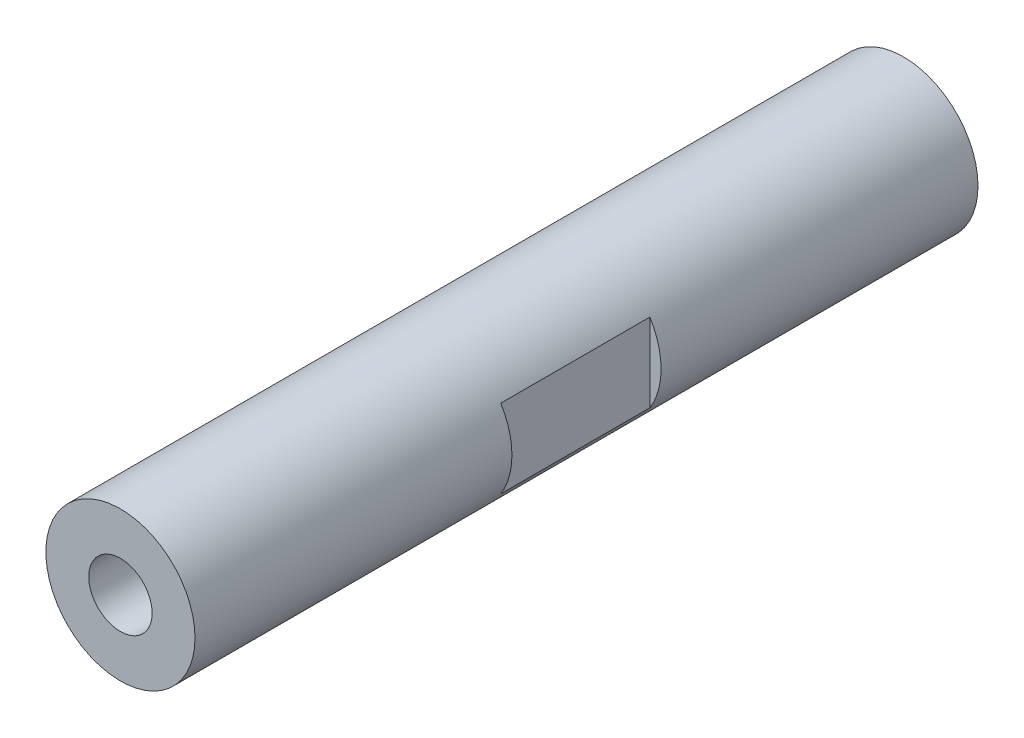
ISO-10303-21;
HEADER;
FILE_DESCRIPTION(('STEP AP214'),'2;1');
FILE_NAME('part.step','',(''),(''),'','','');
FILE_SCHEMA(('AUTOMOTIVE_DESIGN { 1 0 10303 214 1 1 1 1 }'));
ENDSEC;
DATA;
#1=APPLICATION_CONTEXT('core data for automotive mechanical design processes');
#2=APPLICATION_PROTOCOL_DEFINITION('international standard','automotive_design',2000,#1);
#3=PRODUCT_CONTEXT('',#1,'mechanical');
#4=PRODUCT('Part','Part','',(#3));
#5=PRODUCT_RELATED_PRODUCT_CATEGORY('part','',(#4));
#6=PRODUCT_DEFINITION_FORMATION('','',#4);
#7=PRODUCT_DEFINITION_CONTEXT('part definition',#1,'design');
#8=PRODUCT_DEFINITION('design','',#6,#7);
#9=PRODUCT_DEFINITION_SHAPE('','',#8);
#10=(LENGTH_UNIT() NAMED_UNIT(*) SI_UNIT(.MILLI.,.METRE.));
#11=(NAMED_UNIT(*) PLANE_ANGLE_UNIT() SI_UNIT($,.RADIAN.));
#12=(NAMED_UNIT(*) SI_UNIT($,.STERADIAN.) SOLID_ANGLE_UNIT());
#13=UNCERTAINTY_MEASURE_WITH_UNIT(LENGTH_MEASURE(1.E-05),#10,'distance_accuracy_value','');
#14=(GEOMETRIC_REPRESENTATION_CONTEXT(3) GLOBAL_UNCERTAINTY_ASSIGNED_CONTEXT((#13)) GLOBAL_UNIT_ASSIGNED_CONTEXT((#10,
#11,#12)) REPRESENTATION_CONTEXT('',''));
#15=CARTESIAN_POINT('',(0.,0.,0.));
#16=DIRECTION('',(0.,0.,1.));
#17=DIRECTION('',(1.,0.,0.));
#18=AXIS2_PLACEMENT_3D('',#15,#16,#17);
#19=CARTESIAN_POINT('',(0.,0.,52.5));
#20=DIRECTION('',(0.,0.,-1.));
#21=DIRECTION('',(-1.,0.,0.));
#22=AXIS2_PLACEMENT_3D('',#19,#20,#21);
#23=CYLINDRICAL_SURFACE('',#22,10.);
#24=DIRECTION('',(0.,0.,-1.));
#25=VECTOR('',#24,1.);
#26=CARTESIAN_POINT('',(8.5,5.26782687642637,52.5));
#27=LINE('',#26,#25);
#28=CARTESIAN_POINT('',(8.5,5.26782687642637,10.));
#29=VERTEX_POINT('',#28);
#30=CARTESIAN_POINT('',(8.5,5.26782687642637,-10.));
#31=VERTEX_POINT('',#30);
#32=EDGE_CURVE('E43',#29,#31,#27,.T.);
#33=ORIENTED_EDGE('',*,*,#32,.T.);
#34=CARTESIAN_POINT('',(0.,0.,-10.));
#35=DIRECTION('',(0.,0.,-1.));
#36=DIRECTION('',(-1.,0.,0.));
#37=AXIS2_PLACEMENT_3D('',#34,#35,#36);
#38=CIRCLE('',#37,10.);
#39=CARTESIAN_POINT('',(8.5,-5.26782687642637,-10.));
#40=VERTEX_POINT('',#39);
#41=EDGE_CURVE('E11',#31,#40,#38,.T.);
#42=ORIENTED_EDGE('',*,*,#41,.T.);
#43=DIRECTION('',(0.,0.,-1.));
#44=VECTOR('',#43,1.);
#45=CARTESIAN_POINT('',(8.5,-5.26782687642637,52.5));
#46=LINE('',#45,#44);
#47=CARTESIAN_POINT('',(8.5,-5.26782687642637,10.));
#48=VERTEX_POINT('',#47);
#49=EDGE_CURVE('E130',#40,#48,#46,.F.);
#50=ORIENTED_EDGE('',*,*,#49,.T.);
#51=CARTESIAN_POINT('',(0.,0.,10.));
#52=DIRECTION('',(0.,0.,1.));
#53=DIRECTION('',(1.,0.,0.));
#54=AXIS2_PLACEMENT_3D('',#51,#52,#53);
#55=CIRCLE('',#54,10.);
#56=EDGE_CURVE('E127',#48,#29,#55,.T.);
#57=ORIENTED_EDGE('',*,*,#56,.T.);
#58=EDGE_LOOP('',(#33,#42,#50,#57));
#59=FACE_BOUND('',#58,.T.);
#60=DIRECTION('',(0.,0.,-1.));
#61=VECTOR('',#60,1.);
#62=CARTESIAN_POINT('',(-8.5,-5.26782687642637,52.5));
#63=LINE('',#62,#61);
#64=CARTESIAN_POINT('',(-8.5,-5.26782687642637,10.));
#65=VERTEX_POINT('',#64);
#66=CARTESIAN_POINT('',(-8.5,-5.26782687642637,-10.));
#67=VERTEX_POINT('',#66);
#68=EDGE_CURVE('E121',#65,#67,#63,.T.);
#69=ORIENTED_EDGE('',*,*,#68,.T.);
#70=CARTESIAN_POINT('',(0.,0.,-10.));
#71=DIRECTION('',(0.,0.,-1.));
#72=DIRECTION('',(-1.,0.,0.));
#73=AXIS2_PLACEMENT_3D('',#70,#71,#72);
#74=CIRCLE('',#73,10.);
#75=CARTESIAN_POINT('',(-8.5,5.26782687642637,-10.));
#76=VERTEX_POINT('',#75);
#77=EDGE_CURVE('E124',#67,#76,#74,.T.);
#78=ORIENTED_EDGE('',*,*,#77,.T.);
#79=DIRECTION('',(0.,0.,-1.));
#80=VECTOR('',#79,1.);
#81=CARTESIAN_POINT('',(-8.5,5.26782687642637,52.5));
#82=LINE('',#81,#80);
#83=CARTESIAN_POINT('',(-8.5,5.26782687642637,10.));
#84=VERTEX_POINT('',#83);
#85=EDGE_CURVE('E118',#76,#84,#82,.F.);
#86=ORIENTED_EDGE('',*,*,#85,.T.);
#87=CARTESIAN_POINT('',(0.,0.,10.));
#88=DIRECTION('',(0.,0.,1.));
#89=DIRECTION('',(1.,0.,0.));
#90=AXIS2_PLACEMENT_3D('',#87,#88,#89);
#91=CIRCLE('',#90,10.);
#92=EDGE_CURVE('E113',#84,#65,#91,.T.);
#93=ORIENTED_EDGE('',*,*,#92,.T.);
#94=EDGE_LOOP('',(#69,#78,#86,#93));
#95=FACE_BOUND('',#94,.T.);
#96=CARTESIAN_POINT('',(0.,0.,52.5));
#97=DIRECTION('',(0.,0.,1.));
#98=DIRECTION('',(1.,0.,0.));
#99=AXIS2_PLACEMENT_3D('',#96,#97,#98);
#100=CIRCLE('',#99,10.);
#101=CARTESIAN_POINT('',(10.,0.,52.5));
#102=VERTEX_POINT('',#101);
#103=EDGE_CURVE('E110',#102,#102,#100,.T.);
#104=ORIENTED_EDGE('',*,*,#103,.F.);
#105=EDGE_LOOP('',(#104));
#106=FACE_BOUND('',#105,.T.);
#107=CARTESIAN_POINT('',(0.,0.,-52.5));
#108=DIRECTION('',(0.,0.,1.));
#109=DIRECTION('',(1.,0.,0.));
#110=AXIS2_PLACEMENT_3D('',#107,#108,#109);
#111=CIRCLE('',#110,10.);
#112=CARTESIAN_POINT('',(10.,0.,-52.5));
#113=VERTEX_POINT('',#112);
#114=EDGE_CURVE('E108',#113,#113,#111,.T.);
#115=ORIENTED_EDGE('',*,*,#114,.T.);
#116=EDGE_LOOP('',(#115));
#117=FACE_BOUND('',#116,.T.);
#118=ADVANCED_FACE('F36',(#59,#95,#106,#117),#23,.T.);
#119=CARTESIAN_POINT('',(0.,0.,52.5));
#120=DIRECTION('',(0.,0.,1.));
#121=DIRECTION('',(1.,0.,0.));
#122=AXIS2_PLACEMENT_3D('',#119,#120,#121);
#123=PLANE('',#122);
#124=CARTESIAN_POINT('',(0.,0.,52.5));
#125=DIRECTION('',(0.,0.,1.));
#126=DIRECTION('',(1.,0.,0.));
#127=AXIS2_PLACEMENT_3D('',#124,#125,#126);
#128=CIRCLE('',#127,4.24999999999999);
#129=CARTESIAN_POINT('',(4.24999999999999,0.,52.5));
#130=VERTEX_POINT('',#129);
#131=EDGE_CURVE('E90',#130,#130,#128,.T.);
#132=ORIENTED_EDGE('',*,*,#131,.F.);
#133=EDGE_LOOP('',(#132));
#134=FACE_BOUND('',#133,.T.);
#135=ORIENTED_EDGE('',*,*,#103,.T.);
#136=EDGE_LOOP('',(#135));
#137=FACE_BOUND('',#136,.T.);
#138=ADVANCED_FACE('F153',(#134,#137),#123,.T.);
#139=CARTESIAN_POINT('',(0.,0.,-52.5));
#140=DIRECTION('',(0.,0.,1.));
#141=DIRECTION('',(1.,0.,0.));
#142=AXIS2_PLACEMENT_3D('',#139,#140,#141);
#143=PLANE('',#142);
#144=CARTESIAN_POINT('',(0.,0.,-52.5));
#145=DIRECTION('',(0.,0.,-1.));
#146=DIRECTION('',(-1.,0.,0.));
#147=AXIS2_PLACEMENT_3D('',#144,#145,#146);
#148=CIRCLE('',#147,4.24999999999999);
#149=CARTESIAN_POINT('',(-4.24999999999999,0.,-52.5));
#150=VERTEX_POINT('',#149);
#151=EDGE_CURVE('E91',#150,#150,#148,.T.);
#152=ORIENTED_EDGE('',*,*,#151,.F.);
#153=EDGE_LOOP('',(#152));
#154=FACE_BOUND('',#153,.T.);
#155=ORIENTED_EDGE('',*,*,#114,.F.);
#156=EDGE_LOOP('',(#155));
#157=FACE_BOUND('',#156,.T.);
#158=ADVANCED_FACE('F157',(#154,#157),#143,.F.);
#159=CARTESIAN_POINT('',(-8.5,-30.,-10.));
#160=DIRECTION('',(0.,0.,-1.));
#161=DIRECTION('',(-1.,0.,0.));
#162=AXIS2_PLACEMENT_3D('',#159,#160,#161);
#163=PLANE('',#162);
#164=DIRECTION('',(0.,1.,0.));
#165=VECTOR('',#164,1.);
#166=CARTESIAN_POINT('',(-8.5,-30.,-10.));
#167=LINE('',#166,#165);
#168=EDGE_CURVE('E105',#67,#76,#167,.T.);
#169=ORIENTED_EDGE('',*,*,#168,.T.);
#170=ORIENTED_EDGE('',*,*,#77,.F.);
#171=EDGE_LOOP('',(#169,#170));
#172=FACE_BOUND('',#171,.T.);
#173=ADVANCED_FACE('F163',(#172),#163,.F.);
#174=CARTESIAN_POINT('',(-8.5,-30.,10.));
#175=DIRECTION('',(1.,0.,0.));
#176=DIRECTION('',(0.,0.,-1.));
#177=AXIS2_PLACEMENT_3D('',#174,#175,#176);
#178=PLANE('',#177);
#179=DIRECTION('',(0.,1.,0.));
#180=VECTOR('',#179,1.);
#181=CARTESIAN_POINT('',(-8.5,-30.,10.));
#182=LINE('',#181,#180);
#183=EDGE_CURVE('E56',#65,#84,#182,.T.);
#184=ORIENTED_EDGE('',*,*,#183,.T.);
#185=ORIENTED_EDGE('',*,*,#85,.F.);
#186=ORIENTED_EDGE('',*,*,#168,.F.);
#187=ORIENTED_EDGE('',*,*,#68,.F.);
#188=EDGE_LOOP('',(#184,#185,#186,#187));
#189=FACE_BOUND('',#188,.T.);
#190=ADVANCED_FACE('F170',(#189),#178,.F.);
#191=CARTESIAN_POINT('',(-8.5,-30.,10.));
#192=DIRECTION('',(0.,0.,1.));
#193=DIRECTION('',(1.,0.,0.));
#194=AXIS2_PLACEMENT_3D('',#191,#192,#193);
#195=PLANE('',#194);
#196=ORIENTED_EDGE('',*,*,#183,.F.);
#197=ORIENTED_EDGE('',*,*,#92,.F.);
#198=EDGE_LOOP('',(#196,#197));
#199=FACE_BOUND('',#198,.T.);
#200=ADVANCED_FACE('F149',(#199),#195,.F.);
#201=CARTESIAN_POINT('',(8.5,-30.,10.));
#202=DIRECTION('',(-1.,0.,0.));
#203=DIRECTION('',(0.,0.,1.));
#204=AXIS2_PLACEMENT_3D('',#201,#202,#203);
#205=PLANE('',#204);
#206=DIRECTION('',(0.,1.,0.));
#207=VECTOR('',#206,1.);
#208=CARTESIAN_POINT('',(8.5,-30.,10.));
#209=LINE('',#208,#207);
#210=EDGE_CURVE('E49',#48,#29,#209,.T.);
#211=ORIENTED_EDGE('',*,*,#210,.F.);
#212=ORIENTED_EDGE('',*,*,#49,.F.);
#213=DIRECTION('',(0.,1.,0.));
#214=VECTOR('',#213,1.);
#215=CARTESIAN_POINT('',(8.5,-30.,-10.));
#216=LINE('',#215,#214);
#217=EDGE_CURVE('E101',#40,#31,#216,.T.);
#218=ORIENTED_EDGE('',*,*,#217,.T.);
#219=ORIENTED_EDGE('',*,*,#32,.F.);
#220=EDGE_LOOP('',(#211,#212,#218,#219));
#221=FACE_BOUND('',#220,.T.);
#222=ADVANCED_FACE('F136',(#221),#205,.F.);
#223=CARTESIAN_POINT('',(8.5,-30.,-10.));
#224=DIRECTION('',(0.,0.,-1.));
#225=DIRECTION('',(-1.,0.,0.));
#226=AXIS2_PLACEMENT_3D('',#223,#224,#225);
#227=PLANE('',#226);
#228=ORIENTED_EDGE('',*,*,#217,.F.);
#229=ORIENTED_EDGE('',*,*,#41,.F.);
#230=EDGE_LOOP('',(#228,#229));
#231=FACE_BOUND('',#230,.T.);
#232=ADVANCED_FACE('F139',(#231),#227,.F.);
#233=CARTESIAN_POINT('',(8.5,-30.,10.));
#234=DIRECTION('',(0.,0.,1.));
#235=DIRECTION('',(1.,0.,0.));
#236=AXIS2_PLACEMENT_3D('',#233,#234,#235);
#237=PLANE('',#236);
#238=ORIENTED_EDGE('',*,*,#210,.T.);
#239=ORIENTED_EDGE('',*,*,#56,.F.);
#240=EDGE_LOOP('',(#238,#239));
#241=FACE_BOUND('',#240,.T.);
#242=ADVANCED_FACE('F141',(#241),#237,.F.);
#243=CARTESIAN_POINT('',(0.,0.,28.));
#244=DIRECTION('',(0.,0.,1.));
#245=DIRECTION('',(1.,0.,0.));
#246=AXIS2_PLACEMENT_3D('',#243,#244,#245);
#247=CONICAL_SURFACE('',#246,4.24999999999999,1.02974425867665);
#248=CARTESIAN_POINT('',(0.,0.,25.4463423691329));
#249=VERTEX_POINT('',#248);
#250=VERTEX_LOOP('',#249);
#251=FACE_BOUND('',#250,.T.);
#252=CARTESIAN_POINT('',(0.,0.,28.));
#253=DIRECTION('',(0.,0.,1.));
#254=DIRECTION('',(1.,0.,0.));
#255=AXIS2_PLACEMENT_3D('',#252,#253,#254);
#256=CIRCLE('',#255,4.24999999999999);
#257=CARTESIAN_POINT('',(4.24999999999999,0.,28.));
#258=VERTEX_POINT('',#257);
#259=EDGE_CURVE('E94',#258,#258,#256,.T.);
#260=ORIENTED_EDGE('',*,*,#259,.T.);
#261=EDGE_LOOP('',(#260));
#262=FACE_BOUND('',#261,.T.);
#263=ADVANCED_FACE('F147',(#251,#262),#247,.F.);
#264=CARTESIAN_POINT('',(0.,0.,52.5));
#265=DIRECTION('',(0.,0.,1.));
#266=DIRECTION('',(1.,0.,0.));
#267=AXIS2_PLACEMENT_3D('',#264,#265,#266);
#268=CYLINDRICAL_SURFACE('',#267,4.24999999999999);
#269=ORIENTED_EDGE('',*,*,#259,.F.);
#270=EDGE_LOOP('',(#269));
#271=FACE_BOUND('',#270,.T.);
#272=ORIENTED_EDGE('',*,*,#131,.T.);
#273=EDGE_LOOP('',(#272));
#274=FACE_BOUND('',#273,.T.);
#275=ADVANCED_FACE('F84',(#271,#274),#268,.F.);
#276=CARTESIAN_POINT('',(0.,0.,-28.));
#277=DIRECTION('',(0.,0.,-1.));
#278=DIRECTION('',(-1.,0.,0.));
#279=AXIS2_PLACEMENT_3D('',#276,#277,#278);
#280=CONICAL_SURFACE('',#279,4.24999999999999,1.02974425867665);
#281=CARTESIAN_POINT('',(0.,0.,-25.4463423691329));
#282=VERTEX_POINT('',#281);
#283=VERTEX_LOOP('',#282);
#284=FACE_BOUND('',#283,.T.);
#285=CARTESIAN_POINT('',(0.,0.,-28.));
#286=DIRECTION('',(0.,0.,-1.));
#287=DIRECTION('',(-1.,0.,0.));
#288=AXIS2_PLACEMENT_3D('',#285,#286,#287);
#289=CIRCLE('',#288,4.24999999999999);
#290=CARTESIAN_POINT('',(-4.24999999999999,0.,-28.));
#291=VERTEX_POINT('',#290);
#292=EDGE_CURVE('E88',#291,#291,#289,.T.);
#293=ORIENTED_EDGE('',*,*,#292,.T.);
#294=EDGE_LOOP('',(#293));
#295=FACE_BOUND('',#294,.T.);
#296=ADVANCED_FACE('F80',(#284,#295),#280,.F.);
#297=CARTESIAN_POINT('',(0.,0.,-52.5));
#298=DIRECTION('',(0.,0.,-1.));
#299=DIRECTION('',(-1.,0.,0.));
#300=AXIS2_PLACEMENT_3D('',#297,#298,#299);
#301=CYLINDRICAL_SURFACE('',#300,4.24999999999999);
#302=ORIENTED_EDGE('',*,*,#292,.F.);
#303=EDGE_LOOP('',(#302));
#304=FACE_BOUND('',#303,.T.);
#305=ORIENTED_EDGE('',*,*,#151,.T.);
#306=EDGE_LOOP('',(#305));
#307=FACE_BOUND('',#306,.T.);
#308=ADVANCED_FACE('F83',(#304,#307),#301,.F.);
#309=CLOSED_SHELL('',(#118,#138,#158,#173,#190,#200,#222,#232,#242,#263,#275,#296,#308));
#310=MANIFOLD_SOLID_BREP('B2',#309);
#311=ADVANCED_BREP_SHAPE_REPRESENTATION('',(#18,#310),#14);
#312=SHAPE_DEFINITION_REPRESENTATION(#9,#311);
ENDSEC;
END-ISO-10303-21;
